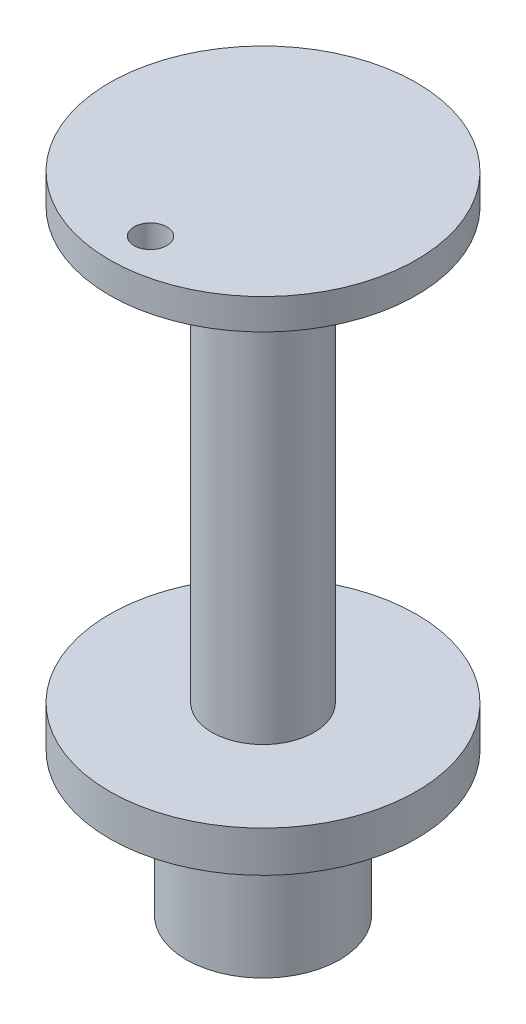
ISO-10303-21;
HEADER;
FILE_DESCRIPTION(('STEP AP214'),'2;1');
FILE_NAME('part.step','',(''),(''),'','','');
FILE_SCHEMA(('AUTOMOTIVE_DESIGN { 1 0 10303 214 1 1 1 1 }'));
ENDSEC;
DATA;
#1=APPLICATION_CONTEXT('core data for automotive mechanical design processes');
#2=APPLICATION_PROTOCOL_DEFINITION('international standard','automotive_design',2000,#1);
#3=PRODUCT_CONTEXT('',#1,'mechanical');
#4=PRODUCT('Part','Part','',(#3));
#5=PRODUCT_RELATED_PRODUCT_CATEGORY('part','',(#4));
#6=PRODUCT_DEFINITION_FORMATION('','',#4);
#7=PRODUCT_DEFINITION_CONTEXT('part definition',#1,'design');
#8=PRODUCT_DEFINITION('design','',#6,#7);
#9=PRODUCT_DEFINITION_SHAPE('','',#8);
#10=(LENGTH_UNIT() NAMED_UNIT(*) SI_UNIT(.MILLI.,.METRE.));
#11=(NAMED_UNIT(*) PLANE_ANGLE_UNIT() SI_UNIT($,.RADIAN.));
#12=(NAMED_UNIT(*) SI_UNIT($,.STERADIAN.) SOLID_ANGLE_UNIT());
#13=UNCERTAINTY_MEASURE_WITH_UNIT(LENGTH_MEASURE(1.E-05),#10,'distance_accuracy_value','');
#14=(GEOMETRIC_REPRESENTATION_CONTEXT(3) GLOBAL_UNCERTAINTY_ASSIGNED_CONTEXT((#13)) GLOBAL_UNIT_ASSIGNED_CONTEXT((#10,
#11,#12)) REPRESENTATION_CONTEXT('',''));
#15=CARTESIAN_POINT('',(0.,0.,0.));
#16=DIRECTION('',(0.,0.,1.));
#17=DIRECTION('',(1.,0.,0.));
#18=AXIS2_PLACEMENT_3D('',#15,#16,#17);
#19=CARTESIAN_POINT('',(0.,2.,0.));
#20=DIRECTION('',(0.,-1.,0.));
#21=DIRECTION('',(0.,0.,-1.));
#22=AXIS2_PLACEMENT_3D('',#19,#20,#21);
#23=CYLINDRICAL_SURFACE('',#22,15.);
#24=CARTESIAN_POINT('',(0.,2.,0.));
#25=DIRECTION('',(0.,1.,0.));
#26=DIRECTION('',(0.,0.,1.));
#27=AXIS2_PLACEMENT_3D('',#24,#25,#26);
#28=CIRCLE('',#27,15.);
#29=CARTESIAN_POINT('',(0.,2.,15.));
#30=VERTEX_POINT('',#29);
#31=EDGE_CURVE('E37',#30,#30,#28,.T.);
#32=ORIENTED_EDGE('',*,*,#31,.F.);
#33=EDGE_LOOP('',(#32));
#34=FACE_BOUND('',#33,.T.);
#35=CARTESIAN_POINT('',(0.,-2.,0.));
#36=DIRECTION('',(0.,1.,0.));
#37=DIRECTION('',(0.,0.,1.));
#38=AXIS2_PLACEMENT_3D('',#35,#36,#37);
#39=CIRCLE('',#38,15.);
#40=CARTESIAN_POINT('',(0.,-2.,15.));
#41=VERTEX_POINT('',#40);
#42=EDGE_CURVE('E41',#41,#41,#39,.T.);
#43=ORIENTED_EDGE('',*,*,#42,.T.);
#44=EDGE_LOOP('',(#43));
#45=FACE_BOUND('',#44,.T.);
#46=ADVANCED_FACE('F31',(#34,#45),#23,.T.);
#47=CARTESIAN_POINT('',(0.,2.,0.));
#48=DIRECTION('',(0.,1.,0.));
#49=DIRECTION('',(0.,0.,1.));
#50=AXIS2_PLACEMENT_3D('',#47,#48,#49);
#51=PLANE('',#50);
#52=CARTESIAN_POINT('',(0.,2.,0.));
#53=DIRECTION('',(0.,1.,0.));
#54=DIRECTION('',(0.,0.,1.));
#55=AXIS2_PLACEMENT_3D('',#52,#53,#54);
#56=CIRCLE('',#55,5.);
#57=CARTESIAN_POINT('',(0.,2.,5.));
#58=VERTEX_POINT('',#57);
#59=EDGE_CURVE('E57',#58,#58,#56,.T.);
#60=ORIENTED_EDGE('',*,*,#59,.F.);
#61=EDGE_LOOP('',(#60));
#62=FACE_BOUND('',#61,.T.);
#63=ORIENTED_EDGE('',*,*,#31,.T.);
#64=EDGE_LOOP('',(#63));
#65=FACE_BOUND('',#64,.T.);
#66=ADVANCED_FACE('F102',(#62,#65),#51,.T.);
#67=CARTESIAN_POINT('',(0.,-2.,0.));
#68=DIRECTION('',(0.,1.,0.));
#69=DIRECTION('',(0.,0.,1.));
#70=AXIS2_PLACEMENT_3D('',#67,#68,#69);
#71=PLANE('',#70);
#72=CARTESIAN_POINT('',(0.,-2.,0.));
#73=DIRECTION('',(0.,1.,0.));
#74=DIRECTION('',(0.,0.,1.));
#75=AXIS2_PLACEMENT_3D('',#72,#73,#74);
#76=CIRCLE('',#75,7.5);
#77=CARTESIAN_POINT('',(0.,-2.,7.5));
#78=VERTEX_POINT('',#77);
#79=EDGE_CURVE('E10',#78,#78,#76,.F.);
#80=ORIENTED_EDGE('',*,*,#79,.F.);
#81=EDGE_LOOP('',(#80));
#82=FACE_BOUND('',#81,.T.);
#83=ORIENTED_EDGE('',*,*,#42,.F.);
#84=EDGE_LOOP('',(#83));
#85=FACE_BOUND('',#84,.T.);
#86=ADVANCED_FACE('F107',(#82,#85),#71,.F.);
#87=CARTESIAN_POINT('',(0.,-16.,0.));
#88=DIRECTION('',(0.,-1.,0.));
#89=DIRECTION('',(0.,0.,-1.));
#90=AXIS2_PLACEMENT_3D('',#87,#88,#89);
#91=PLANE('',#90);
#92=CARTESIAN_POINT('',(0.,-16.,0.));
#93=DIRECTION('',(0.,-1.,0.));
#94=DIRECTION('',(0.,0.,-1.));
#95=AXIS2_PLACEMENT_3D('',#92,#93,#94);
#96=CIRCLE('',#95,7.5);
#97=CARTESIAN_POINT('',(0.,-16.,-7.5));
#98=VERTEX_POINT('',#97);
#99=EDGE_CURVE('E46',#98,#98,#96,.T.);
#100=ORIENTED_EDGE('',*,*,#99,.T.);
#101=EDGE_LOOP('',(#100));
#102=FACE_BOUND('',#101,.T.);
#103=CARTESIAN_POINT('',(0.,-16.,0.));
#104=DIRECTION('',(0.,-1.,0.));
#105=DIRECTION('',(0.,0.,-1.));
#106=AXIS2_PLACEMENT_3D('',#103,#104,#105);
#107=CIRCLE('',#106,6.3);
#108=CARTESIAN_POINT('',(0.,-16.,-6.3));
#109=VERTEX_POINT('',#108);
#110=EDGE_CURVE('E50',#109,#109,#107,.T.);
#111=ORIENTED_EDGE('',*,*,#110,.F.);
#112=EDGE_LOOP('',(#111));
#113=FACE_BOUND('',#112,.T.);
#114=ADVANCED_FACE('F114',(#102,#113),#91,.T.);
#115=CARTESIAN_POINT('',(0.,-16.,0.));
#116=DIRECTION('',(0.,1.,0.));
#117=DIRECTION('',(0.,0.,1.));
#118=AXIS2_PLACEMENT_3D('',#115,#116,#117);
#119=CYLINDRICAL_SURFACE('',#118,7.5);
#120=ORIENTED_EDGE('',*,*,#99,.F.);
#121=EDGE_LOOP('',(#120));
#122=FACE_BOUND('',#121,.T.);
#123=ORIENTED_EDGE('',*,*,#79,.T.);
#124=EDGE_LOOP('',(#123));
#125=FACE_BOUND('',#124,.T.);
#126=ADVANCED_FACE('F120',(#122,#125),#119,.T.);
#127=CARTESIAN_POINT('',(0.,-16.,0.));
#128=DIRECTION('',(0.,1.,0.));
#129=DIRECTION('',(0.,0.,1.));
#130=AXIS2_PLACEMENT_3D('',#127,#128,#129);
#131=CYLINDRICAL_SURFACE('',#130,6.3);
#132=ORIENTED_EDGE('',*,*,#110,.T.);
#133=EDGE_LOOP('',(#132));
#134=FACE_BOUND('',#133,.T.);
#135=CARTESIAN_POINT('',(0.,-2.,0.));
#136=DIRECTION('',(0.,-1.,0.));
#137=DIRECTION('',(0.,0.,-1.));
#138=AXIS2_PLACEMENT_3D('',#135,#136,#137);
#139=CIRCLE('',#138,6.3);
#140=CARTESIAN_POINT('',(0.,-2.,-6.3));
#141=VERTEX_POINT('',#140);
#142=EDGE_CURVE('E51',#141,#141,#139,.T.);
#143=ORIENTED_EDGE('',*,*,#142,.F.);
#144=EDGE_LOOP('',(#143));
#145=FACE_BOUND('',#144,.T.);
#146=ADVANCED_FACE('F124',(#134,#145),#131,.F.);
#147=ORIENTED_EDGE('',*,*,#142,.T.);
#148=EDGE_LOOP('',(#147));
#149=FACE_BOUND('',#148,.T.);
#150=ADVANCED_FACE('F116',(#149),#71,.F.);
#151=CARTESIAN_POINT('',(0.,44.,0.));
#152=DIRECTION('',(0.,-1.,0.));
#153=DIRECTION('',(0.,0.,-1.));
#154=AXIS2_PLACEMENT_3D('',#151,#152,#153);
#155=CYLINDRICAL_SURFACE('',#154,5.);
#156=CARTESIAN_POINT('',(0.,44.,0.));
#157=DIRECTION('',(0.,1.,0.));
#158=DIRECTION('',(0.,0.,1.));
#159=AXIS2_PLACEMENT_3D('',#156,#157,#158);
#160=CIRCLE('',#159,5.);
#161=CARTESIAN_POINT('',(0.,44.,5.));
#162=VERTEX_POINT('',#161);
#163=EDGE_CURVE('E54',#162,#162,#160,.T.);
#164=ORIENTED_EDGE('',*,*,#163,.F.);
#165=EDGE_LOOP('',(#164));
#166=FACE_BOUND('',#165,.T.);
#167=ORIENTED_EDGE('',*,*,#59,.T.);
#168=EDGE_LOOP('',(#167));
#169=FACE_BOUND('',#168,.T.);
#170=ADVANCED_FACE('F93',(#166,#169),#155,.T.);
#171=CARTESIAN_POINT('',(0.,47.,0.));
#172=DIRECTION('',(0.,-1.,0.));
#173=DIRECTION('',(0.,0.,-1.));
#174=AXIS2_PLACEMENT_3D('',#171,#172,#173);
#175=CYLINDRICAL_SURFACE('',#174,15.);
#176=CARTESIAN_POINT('',(0.,47.,0.));
#177=DIRECTION('',(0.,1.,0.));
#178=DIRECTION('',(0.,0.,1.));
#179=AXIS2_PLACEMENT_3D('',#176,#177,#178);
#180=CIRCLE('',#179,15.);
#181=CARTESIAN_POINT('',(0.,47.,15.));
#182=VERTEX_POINT('',#181);
#183=EDGE_CURVE('E60',#182,#182,#180,.T.);
#184=ORIENTED_EDGE('',*,*,#183,.F.);
#185=EDGE_LOOP('',(#184));
#186=FACE_BOUND('',#185,.T.);
#187=CARTESIAN_POINT('',(0.,44.,0.));
#188=DIRECTION('',(0.,1.,0.));
#189=DIRECTION('',(0.,0.,1.));
#190=AXIS2_PLACEMENT_3D('',#187,#188,#189);
#191=CIRCLE('',#190,15.);
#192=CARTESIAN_POINT('',(0.,44.,15.));
#193=VERTEX_POINT('',#192);
#194=EDGE_CURVE('E63',#193,#193,#191,.T.);
#195=ORIENTED_EDGE('',*,*,#194,.T.);
#196=EDGE_LOOP('',(#195));
#197=FACE_BOUND('',#196,.T.);
#198=ADVANCED_FACE('F87',(#186,#197),#175,.T.);
#199=CARTESIAN_POINT('',(0.,47.,0.));
#200=DIRECTION('',(0.,1.,0.));
#201=DIRECTION('',(0.,0.,1.));
#202=AXIS2_PLACEMENT_3D('',#199,#200,#201);
#203=PLANE('',#202);
#204=CARTESIAN_POINT('',(0.,47.,11.));
#205=DIRECTION('',(0.,1.,0.));
#206=DIRECTION('',(0.,0.,1.));
#207=AXIS2_PLACEMENT_3D('',#204,#205,#206);
#208=CIRCLE('',#207,1.6);
#209=CARTESIAN_POINT('',(0.,47.,12.6));
#210=VERTEX_POINT('',#209);
#211=EDGE_CURVE('E69',#210,#210,#208,.T.);
#212=ORIENTED_EDGE('',*,*,#211,.F.);
#213=EDGE_LOOP('',(#212));
#214=FACE_BOUND('',#213,.T.);
#215=ORIENTED_EDGE('',*,*,#183,.T.);
#216=EDGE_LOOP('',(#215));
#217=FACE_BOUND('',#216,.T.);
#218=ADVANCED_FACE('F84',(#214,#217),#203,.T.);
#219=CARTESIAN_POINT('',(0.,44.,0.));
#220=DIRECTION('',(0.,1.,0.));
#221=DIRECTION('',(0.,0.,1.));
#222=AXIS2_PLACEMENT_3D('',#219,#220,#221);
#223=PLANE('',#222);
#224=CARTESIAN_POINT('',(0.,44.,11.));
#225=DIRECTION('',(0.,1.,0.));
#226=DIRECTION('',(0.,0.,1.));
#227=AXIS2_PLACEMENT_3D('',#224,#225,#226);
#228=CIRCLE('',#227,1.6);
#229=CARTESIAN_POINT('',(0.,44.,12.6));
#230=VERTEX_POINT('',#229);
#231=EDGE_CURVE('E66',#230,#230,#228,.T.);
#232=ORIENTED_EDGE('',*,*,#231,.T.);
#233=EDGE_LOOP('',(#232));
#234=FACE_BOUND('',#233,.T.);
#235=ORIENTED_EDGE('',*,*,#163,.T.);
#236=EDGE_LOOP('',(#235));
#237=FACE_BOUND('',#236,.T.);
#238=ORIENTED_EDGE('',*,*,#194,.F.);
#239=EDGE_LOOP('',(#238));
#240=FACE_BOUND('',#239,.T.);
#241=ADVANCED_FACE('F75',(#234,#237,#240),#223,.F.);
#242=CARTESIAN_POINT('',(0.,44.,11.));
#243=DIRECTION('',(0.,1.,0.));
#244=DIRECTION('',(0.,0.,1.));
#245=AXIS2_PLACEMENT_3D('',#242,#243,#244);
#246=CYLINDRICAL_SURFACE('',#245,1.6);
#247=ORIENTED_EDGE('',*,*,#231,.F.);
#248=EDGE_LOOP('',(#247));
#249=FACE_BOUND('',#248,.T.);
#250=ORIENTED_EDGE('',*,*,#211,.T.);
#251=EDGE_LOOP('',(#250));
#252=FACE_BOUND('',#251,.T.);
#253=ADVANCED_FACE('F78',(#249,#252),#246,.F.);
#254=CLOSED_SHELL('',(#46,#66,#86,#114,#126,#146,#150,#170,#198,#218,#241,#253));
#255=MANIFOLD_SOLID_BREP('B2',#254);
#256=ADVANCED_BREP_SHAPE_REPRESENTATION('',(#18,#255),#14);
#257=SHAPE_DEFINITION_REPRESENTATION(#9,#256);
ENDSEC;
END-ISO-10303-21;
